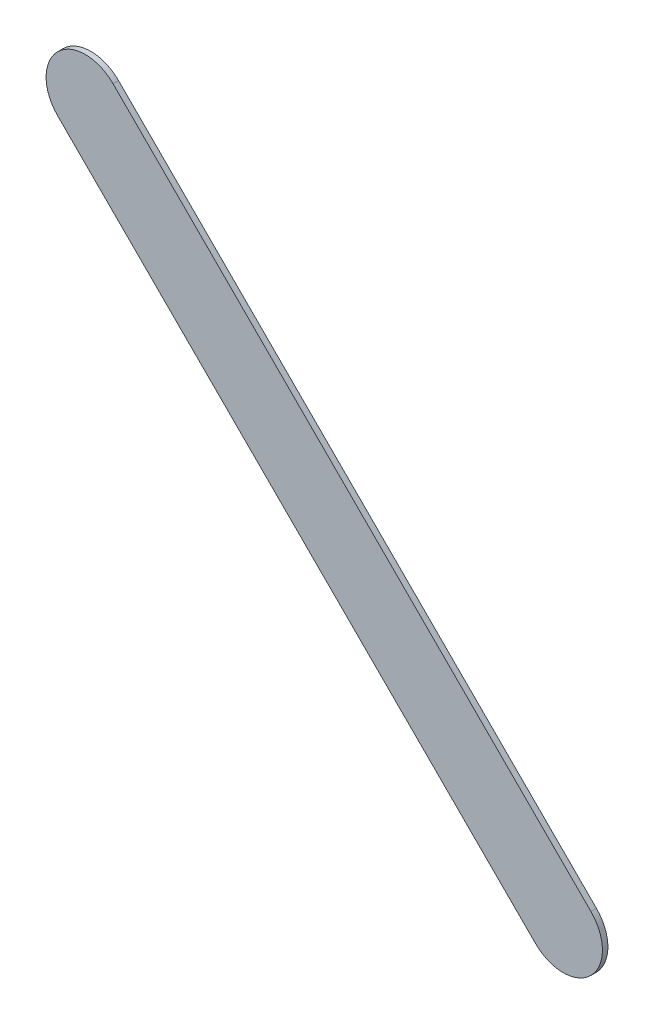
ISO-10303-21;
HEADER;
FILE_DESCRIPTION(('STEP AP214'),'2;1');
FILE_NAME('part.step','',(''),(''),'','','');
FILE_SCHEMA(('AUTOMOTIVE_DESIGN { 1 0 10303 214 1 1 1 1 }'));
ENDSEC;
DATA;
#1=APPLICATION_CONTEXT('core data for automotive mechanical design processes');
#2=APPLICATION_PROTOCOL_DEFINITION('international standard','automotive_design',2000,#1);
#3=PRODUCT_CONTEXT('',#1,'mechanical');
#4=PRODUCT('Part','Part','',(#3));
#5=PRODUCT_RELATED_PRODUCT_CATEGORY('part','',(#4));
#6=PRODUCT_DEFINITION_FORMATION('','',#4);
#7=PRODUCT_DEFINITION_CONTEXT('part definition',#1,'design');
#8=PRODUCT_DEFINITION('design','',#6,#7);
#9=PRODUCT_DEFINITION_SHAPE('','',#8);
#10=(LENGTH_UNIT() NAMED_UNIT(*) SI_UNIT(.MILLI.,.METRE.));
#11=(NAMED_UNIT(*) PLANE_ANGLE_UNIT() SI_UNIT($,.RADIAN.));
#12=(NAMED_UNIT(*) SI_UNIT($,.STERADIAN.) SOLID_ANGLE_UNIT());
#13=UNCERTAINTY_MEASURE_WITH_UNIT(LENGTH_MEASURE(1.E-05),#10,'distance_accuracy_value','');
#14=(GEOMETRIC_REPRESENTATION_CONTEXT(3) GLOBAL_UNCERTAINTY_ASSIGNED_CONTEXT((#13)) GLOBAL_UNIT_ASSIGNED_CONTEXT((#10,
#11,#12)) REPRESENTATION_CONTEXT('',''));
#15=CARTESIAN_POINT('',(0.,0.,0.));
#16=DIRECTION('',(0.,0.,1.));
#17=DIRECTION('',(1.,0.,0.));
#18=AXIS2_PLACEMENT_3D('',#15,#16,#17);
#19=CARTESIAN_POINT('',(173.051223,-88.568776,0.));
#20=DIRECTION('',(0.,0.,1.));
#21=DIRECTION('',(1.,0.,0.));
#22=AXIS2_PLACEMENT_3D('',#19,#20,#21);
#23=PLANE('',#22);
#24=DIRECTION('',(0.707106781186548,-0.707106781186548,0.));
#25=VECTOR('',#24,1.);
#26=CARTESIAN_POINT('',(173.051223,-88.568776,0.));
#27=LINE('',#26,#25);
#28=CARTESIAN_POINT('',(173.051223,-88.568776,0.));
#29=VERTEX_POINT('',#28);
#30=CARTESIAN_POINT('',(176.099223,-91.616776,0.));
#31=VERTEX_POINT('',#30);
#32=EDGE_CURVE('E76',#29,#31,#27,.T.);
#33=ORIENTED_EDGE('',*,*,#32,.T.);
#34=CARTESIAN_POINT('',(176.2759995,-91.4399995,0.));
#35=DIRECTION('',(0.,0.,1.));
#36=DIRECTION('',(-0.707106781186548,-0.707106781186548,0.));
#37=AXIS2_PLACEMENT_3D('',#34,#35,#36);
#38=CIRCLE('',#37,0.249999723809);
#39=CARTESIAN_POINT('',(176.452776,-91.263223,0.));
#40=VERTEX_POINT('',#39);
#41=EDGE_CURVE('E74',#31,#40,#38,.T.);
#42=ORIENTED_EDGE('',*,*,#41,.T.);
#43=DIRECTION('',(-0.707106781186548,0.707106781186548,0.));
#44=VECTOR('',#43,1.);
#45=CARTESIAN_POINT('',(176.452776,-91.263223,0.));
#46=LINE('',#45,#44);
#47=CARTESIAN_POINT('',(173.404776,-88.215223,0.));
#48=VERTEX_POINT('',#47);
#49=EDGE_CURVE('E62',#40,#48,#46,.T.);
#50=ORIENTED_EDGE('',*,*,#49,.T.);
#51=CARTESIAN_POINT('',(173.2279995,-88.3919995,0.));
#52=DIRECTION('',(0.,0.,1.));
#53=DIRECTION('',(0.707106781186548,0.707106781186548,0.));
#54=AXIS2_PLACEMENT_3D('',#51,#52,#53);
#55=CIRCLE('',#54,0.249999723809);
#56=EDGE_CURVE('E11',#48,#29,#55,.T.);
#57=ORIENTED_EDGE('',*,*,#56,.T.);
#58=EDGE_LOOP('',(#33,#42,#50,#57));
#59=FACE_BOUND('',#58,.T.);
#60=ADVANCED_FACE('F17',(#59),#23,.T.);
#61=CARTESIAN_POINT('',(173.051223,-88.568776,-0.035));
#62=DIRECTION('',(0.,0.,1.));
#63=DIRECTION('',(1.,0.,0.));
#64=AXIS2_PLACEMENT_3D('',#61,#62,#63);
#65=PLANE('',#64);
#66=CARTESIAN_POINT('',(173.2279995,-88.3919995,-0.035));
#67=DIRECTION('',(0.,0.,1.));
#68=DIRECTION('',(0.707106781186548,0.707106781186548,0.));
#69=AXIS2_PLACEMENT_3D('',#66,#67,#68);
#70=CIRCLE('',#69,0.249999723809);
#71=CARTESIAN_POINT('',(173.404776,-88.215223,-0.035));
#72=VERTEX_POINT('',#71);
#73=CARTESIAN_POINT('',(173.051223,-88.568776,-0.035));
#74=VERTEX_POINT('',#73);
#75=EDGE_CURVE('E26',#72,#74,#70,.T.);
#76=ORIENTED_EDGE('',*,*,#75,.F.);
#77=DIRECTION('',(-0.707106781186548,0.707106781186548,0.));
#78=VECTOR('',#77,1.);
#79=CARTESIAN_POINT('',(176.452776,-91.263223,-0.035));
#80=LINE('',#79,#78);
#81=CARTESIAN_POINT('',(176.452776,-91.263223,-0.035));
#82=VERTEX_POINT('',#81);
#83=EDGE_CURVE('E81',#82,#72,#80,.T.);
#84=ORIENTED_EDGE('',*,*,#83,.F.);
#85=CARTESIAN_POINT('',(176.2759995,-91.4399995,-0.035));
#86=DIRECTION('',(0.,0.,1.));
#87=DIRECTION('',(-0.707106781186548,-0.707106781186548,0.));
#88=AXIS2_PLACEMENT_3D('',#85,#86,#87);
#89=CIRCLE('',#88,0.249999723809);
#90=CARTESIAN_POINT('',(176.099223,-91.616776,-0.035));
#91=VERTEX_POINT('',#90);
#92=EDGE_CURVE('E84',#91,#82,#89,.T.);
#93=ORIENTED_EDGE('',*,*,#92,.F.);
#94=DIRECTION('',(0.707106781186548,-0.707106781186548,0.));
#95=VECTOR('',#94,1.);
#96=CARTESIAN_POINT('',(173.051223,-88.568776,-0.035));
#97=LINE('',#96,#95);
#98=EDGE_CURVE('E105',#74,#91,#97,.T.);
#99=ORIENTED_EDGE('',*,*,#98,.F.);
#100=EDGE_LOOP('',(#76,#84,#93,#99));
#101=FACE_BOUND('',#100,.T.);
#102=ADVANCED_FACE('F108',(#101),#65,.F.);
#103=CARTESIAN_POINT('',(173.2279995,-88.3919995,-0.035));
#104=DIRECTION('',(0.,0.,-1.));
#105=DIRECTION('',(0.707106781186548,0.707106781186548,0.));
#106=AXIS2_PLACEMENT_3D('',#103,#104,#105);
#107=CYLINDRICAL_SURFACE('',#106,0.249999723809);
#108=ORIENTED_EDGE('',*,*,#75,.T.);
#109=DIRECTION('',(0.,0.,1.));
#110=VECTOR('',#109,1.);
#111=CARTESIAN_POINT('',(173.051223,-88.568776,-0.035));
#112=LINE('',#111,#110);
#113=EDGE_CURVE('E91',#74,#29,#112,.T.);
#114=ORIENTED_EDGE('',*,*,#113,.T.);
#115=ORIENTED_EDGE('',*,*,#56,.F.);
#116=DIRECTION('',(0.,0.,1.));
#117=VECTOR('',#116,1.);
#118=CARTESIAN_POINT('',(173.404776,-88.215223,-0.035));
#119=LINE('',#118,#117);
#120=EDGE_CURVE('E69',#72,#48,#119,.T.);
#121=ORIENTED_EDGE('',*,*,#120,.F.);
#122=EDGE_LOOP('',(#108,#114,#115,#121));
#123=FACE_BOUND('',#122,.T.);
#124=ADVANCED_FACE('F99',(#123),#107,.T.);
#125=CARTESIAN_POINT('',(176.452776,-91.263223,-0.035));
#126=DIRECTION('',(-0.707106781186548,-0.707106781186548,0.));
#127=DIRECTION('',(-0.707106781186548,0.707106781186548,0.));
#128=AXIS2_PLACEMENT_3D('',#125,#126,#127);
#129=PLANE('',#128);
#130=ORIENTED_EDGE('',*,*,#83,.T.);
#131=ORIENTED_EDGE('',*,*,#120,.T.);
#132=ORIENTED_EDGE('',*,*,#49,.F.);
#133=DIRECTION('',(0.,0.,1.));
#134=VECTOR('',#133,1.);
#135=CARTESIAN_POINT('',(176.452776,-91.263223,-0.035));
#136=LINE('',#135,#134);
#137=EDGE_CURVE('E67',#82,#40,#136,.T.);
#138=ORIENTED_EDGE('',*,*,#137,.F.);
#139=EDGE_LOOP('',(#130,#131,#132,#138));
#140=FACE_BOUND('',#139,.T.);
#141=ADVANCED_FACE('F65',(#140),#129,.F.);
#142=CARTESIAN_POINT('',(176.2759995,-91.4399995,-0.035));
#143=DIRECTION('',(0.,0.,-1.));
#144=DIRECTION('',(-0.707106781186548,-0.707106781186548,0.));
#145=AXIS2_PLACEMENT_3D('',#142,#143,#144);
#146=CYLINDRICAL_SURFACE('',#145,0.249999723809);
#147=ORIENTED_EDGE('',*,*,#92,.T.);
#148=ORIENTED_EDGE('',*,*,#137,.T.);
#149=ORIENTED_EDGE('',*,*,#41,.F.);
#150=DIRECTION('',(0.,0.,1.));
#151=VECTOR('',#150,1.);
#152=CARTESIAN_POINT('',(176.099223,-91.616776,-0.035));
#153=LINE('',#152,#151);
#154=EDGE_CURVE('E110',#91,#31,#153,.T.);
#155=ORIENTED_EDGE('',*,*,#154,.F.);
#156=EDGE_LOOP('',(#147,#148,#149,#155));
#157=FACE_BOUND('',#156,.T.);
#158=ADVANCED_FACE('F83',(#157),#146,.T.);
#159=CARTESIAN_POINT('',(173.051223,-88.568776,-0.035));
#160=DIRECTION('',(0.707106781186548,0.707106781186548,0.));
#161=DIRECTION('',(0.,0.,-1.));
#162=AXIS2_PLACEMENT_3D('',#159,#160,#161);
#163=PLANE('',#162);
#164=ORIENTED_EDGE('',*,*,#98,.T.);
#165=ORIENTED_EDGE('',*,*,#154,.T.);
#166=ORIENTED_EDGE('',*,*,#32,.F.);
#167=ORIENTED_EDGE('',*,*,#113,.F.);
#168=EDGE_LOOP('',(#164,#165,#166,#167));
#169=FACE_BOUND('',#168,.T.);
#170=ADVANCED_FACE('F104',(#169),#163,.F.);
#171=CLOSED_SHELL('',(#60,#102,#124,#141,#158,#170));
#172=MANIFOLD_SOLID_BREP('B1',#171);
#173=ADVANCED_BREP_SHAPE_REPRESENTATION('',(#18,#172),#14);
#174=SHAPE_DEFINITION_REPRESENTATION(#9,#173);
ENDSEC;
END-ISO-10303-21;
